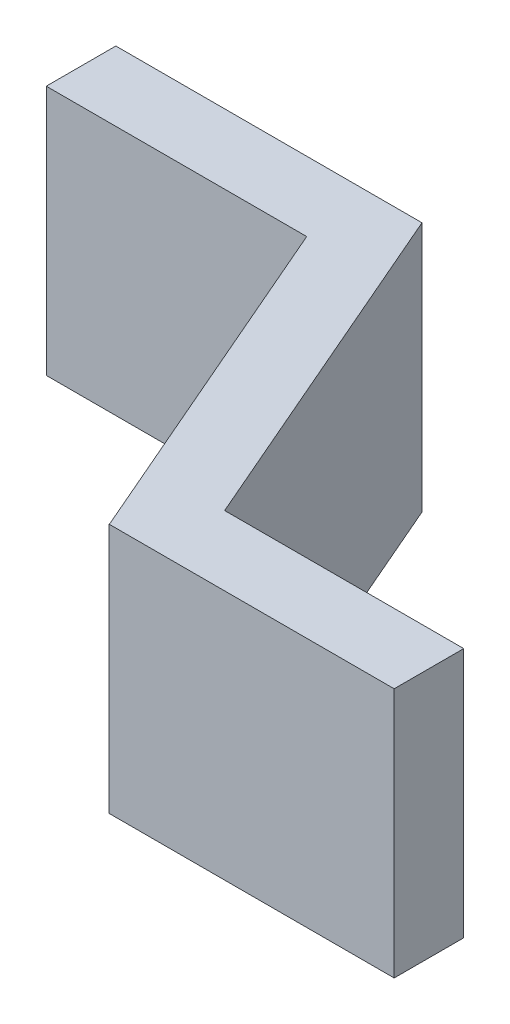
ISO-10303-21;
HEADER;
FILE_DESCRIPTION(('STEP AP214'),'2;1');
FILE_NAME('part.step','',(''),(''),'','','');
FILE_SCHEMA(('AUTOMOTIVE_DESIGN { 1 0 10303 214 1 1 1 1 }'));
ENDSEC;
DATA;
#1=APPLICATION_CONTEXT('core data for automotive mechanical design processes');
#2=APPLICATION_PROTOCOL_DEFINITION('international standard','automotive_design',2000,#1);
#3=PRODUCT_CONTEXT('',#1,'mechanical');
#4=PRODUCT('Part','Part','',(#3));
#5=PRODUCT_RELATED_PRODUCT_CATEGORY('part','',(#4));
#6=PRODUCT_DEFINITION_FORMATION('','',#4);
#7=PRODUCT_DEFINITION_CONTEXT('part definition',#1,'design');
#8=PRODUCT_DEFINITION('design','',#6,#7);
#9=PRODUCT_DEFINITION_SHAPE('','',#8);
#10=(LENGTH_UNIT() NAMED_UNIT(*) SI_UNIT(.MILLI.,.METRE.));
#11=(NAMED_UNIT(*) PLANE_ANGLE_UNIT() SI_UNIT($,.RADIAN.));
#12=(NAMED_UNIT(*) SI_UNIT($,.STERADIAN.) SOLID_ANGLE_UNIT());
#13=UNCERTAINTY_MEASURE_WITH_UNIT(LENGTH_MEASURE(1.E-05),#10,'distance_accuracy_value','');
#14=(GEOMETRIC_REPRESENTATION_CONTEXT(3) GLOBAL_UNCERTAINTY_ASSIGNED_CONTEXT((#13)) GLOBAL_UNIT_ASSIGNED_CONTEXT((#10,
#11,#12)) REPRESENTATION_CONTEXT('',''));
#15=CARTESIAN_POINT('',(0.,0.,0.));
#16=DIRECTION('',(0.,0.,1.));
#17=DIRECTION('',(1.,0.,0.));
#18=AXIS2_PLACEMENT_3D('',#15,#16,#17);
#19=CARTESIAN_POINT('',(0.,3.42,0.));
#20=DIRECTION('',(1.,0.,0.));
#21=DIRECTION('',(0.,0.,-1.));
#22=AXIS2_PLACEMENT_3D('',#19,#20,#21);
#23=PLANE('',#22);
#24=DIRECTION('',(0.,1.,0.));
#25=VECTOR('',#24,1.);
#26=CARTESIAN_POINT('',(0.,3.42,0.));
#27=LINE('',#26,#25);
#28=CARTESIAN_POINT('',(0.,3.780000014305,-1.30339419427667E-10));
#29=VERTEX_POINT('',#28);
#30=CARTESIAN_POINT('',(0.,3.42,-1.556831963824E-10));
#31=VERTEX_POINT('',#30);
#32=EDGE_CURVE('E123',#29,#31,#27,.F.);
#33=ORIENTED_EDGE('',*,*,#32,.T.);
#34=DIRECTION('',(0.,0.,1.));
#35=VECTOR('',#34,1.);
#36=CARTESIAN_POINT('',(0.,3.42,0.));
#37=LINE('',#36,#35);
#38=CARTESIAN_POINT('',(0.,3.42,0.10000000149));
#39=VERTEX_POINT('',#38);
#40=EDGE_CURVE('E115',#31,#39,#37,.T.);
#41=ORIENTED_EDGE('',*,*,#40,.T.);
#42=DIRECTION('',(0.,1.,0.));
#43=VECTOR('',#42,1.);
#44=CARTESIAN_POINT('',(0.,3.42,0.10000000149));
#45=LINE('',#44,#43);
#46=CARTESIAN_POINT('',(0.,3.780000014305,0.10000000149));
#47=VERTEX_POINT('',#46);
#48=EDGE_CURVE('E134',#47,#39,#45,.F.);
#49=ORIENTED_EDGE('',*,*,#48,.F.);
#50=DIRECTION('',(0.,0.,1.));
#51=VECTOR('',#50,1.);
#52=CARTESIAN_POINT('',(0.,3.780000014305,0.));
#53=LINE('',#52,#51);
#54=EDGE_CURVE('E140',#29,#47,#53,.T.);
#55=ORIENTED_EDGE('',*,*,#54,.F.);
#56=EDGE_LOOP('',(#33,#41,#49,#55));
#57=FACE_BOUND('',#56,.T.);
#58=ADVANCED_FACE('F17',(#57),#23,.F.);
#59=CARTESIAN_POINT('',(0.,3.42,0.10000000149));
#60=DIRECTION('',(0.,0.,1.));
#61=DIRECTION('',(1.,0.,0.));
#62=AXIS2_PLACEMENT_3D('',#59,#60,#61);
#63=PLANE('',#62);
#64=DIRECTION('',(0.,1.,0.));
#65=VECTOR('',#64,1.);
#66=CARTESIAN_POINT('',(0.374312226605181,3.42,0.100000001489922));
#67=LINE('',#66,#65);
#68=CARTESIAN_POINT('',(0.37431222660506,3.780000014305,0.100000001489974));
#69=VERTEX_POINT('',#68);
#70=CARTESIAN_POINT('',(0.374312226605091,3.42,0.100000001489974));
#71=VERTEX_POINT('',#70);
#72=EDGE_CURVE('E132',#69,#71,#67,.F.);
#73=ORIENTED_EDGE('',*,*,#72,.F.);
#74=DIRECTION('',(1.,0.,0.));
#75=VECTOR('',#74,1.);
#76=CARTESIAN_POINT('',(0.44,3.780000014305,0.10000000149));
#77=LINE('',#76,#75);
#78=EDGE_CURVE('E137',#47,#69,#77,.T.);
#79=ORIENTED_EDGE('',*,*,#78,.F.);
#80=ORIENTED_EDGE('',*,*,#48,.T.);
#81=DIRECTION('',(1.,0.,0.));
#82=VECTOR('',#81,1.);
#83=CARTESIAN_POINT('',(0.44,3.42,0.10000000149));
#84=LINE('',#83,#82);
#85=EDGE_CURVE('E111',#39,#71,#84,.T.);
#86=ORIENTED_EDGE('',*,*,#85,.T.);
#87=EDGE_LOOP('',(#73,#79,#80,#86));
#88=FACE_BOUND('',#87,.T.);
#89=ADVANCED_FACE('F214',(#88),#63,.T.);
#90=CARTESIAN_POINT('',(0.348224508223,3.42,0.03971472531736));
#91=DIRECTION('',(-0.917754904098641,0.,0.397147247255844));
#92=DIRECTION('',(0.397147247255844,0.,0.917754904098641));
#93=AXIS2_PLACEMENT_3D('',#90,#91,#92);
#94=PLANE('',#93);
#95=DIRECTION('',(0.397147247255413,0.,0.917754904098827));
#96=VECTOR('',#95,1.);
#97=CARTESIAN_POINT('',(0.374312226605,3.42,0.10000000149));
#98=LINE('',#97,#96);
#99=CARTESIAN_POINT('',(0.59,3.42,0.59842599627));
#100=VERTEX_POINT('',#99);
#101=EDGE_CURVE('E110',#71,#100,#98,.T.);
#102=ORIENTED_EDGE('',*,*,#101,.T.);
#103=DIRECTION('',(0.,1.,0.));
#104=VECTOR('',#103,1.);
#105=CARTESIAN_POINT('',(0.59,3.42,0.59842599627));
#106=LINE('',#105,#104);
#107=CARTESIAN_POINT('',(0.59,3.780000014305,0.59842599627));
#108=VERTEX_POINT('',#107);
#109=EDGE_CURVE('E86',#100,#108,#106,.T.);
#110=ORIENTED_EDGE('',*,*,#109,.T.);
#111=DIRECTION('',(0.397147247255413,0.,0.917754904098827));
#112=VECTOR('',#111,1.);
#113=CARTESIAN_POINT('',(0.374312226605,3.780000014305,0.10000000149));
#114=LINE('',#113,#112);
#115=EDGE_CURVE('E139',#69,#108,#114,.T.);
#116=ORIENTED_EDGE('',*,*,#115,.F.);
#117=ORIENTED_EDGE('',*,*,#72,.T.);
#118=EDGE_LOOP('',(#102,#110,#116,#117));
#119=FACE_BOUND('',#118,.T.);
#120=ADVANCED_FACE('F215',(#119),#94,.T.);
#121=CARTESIAN_POINT('',(0.59,3.42,0.5));
#122=DIRECTION('',(1.,0.,0.));
#123=DIRECTION('',(0.,0.,-1.));
#124=AXIS2_PLACEMENT_3D('',#121,#122,#123);
#125=PLANE('',#124);
#126=ORIENTED_EDGE('',*,*,#109,.F.);
#127=DIRECTION('',(0.,0.,-1.));
#128=VECTOR('',#127,1.);
#129=CARTESIAN_POINT('',(0.59,3.42,0.5));
#130=LINE('',#129,#128);
#131=CARTESIAN_POINT('',(0.59,3.42,0.60000000149));
#132=VERTEX_POINT('',#131);
#133=EDGE_CURVE('E20',#100,#132,#130,.F.);
#134=ORIENTED_EDGE('',*,*,#133,.T.);
#135=DIRECTION('',(0.,1.,0.));
#136=VECTOR('',#135,1.);
#137=CARTESIAN_POINT('',(0.59,3.42,0.60000000149));
#138=LINE('',#137,#136);
#139=CARTESIAN_POINT('',(0.59,3.780000014305,0.60000000149));
#140=VERTEX_POINT('',#139);
#141=EDGE_CURVE('E93',#140,#132,#138,.F.);
#142=ORIENTED_EDGE('',*,*,#141,.F.);
#143=DIRECTION('',(0.,0.,1.));
#144=VECTOR('',#143,1.);
#145=CARTESIAN_POINT('',(0.59,3.780000014305,0.));
#146=LINE('',#145,#144);
#147=EDGE_CURVE('E182',#108,#140,#146,.T.);
#148=ORIENTED_EDGE('',*,*,#147,.F.);
#149=EDGE_LOOP('',(#126,#134,#142,#148));
#150=FACE_BOUND('',#149,.T.);
#151=ADVANCED_FACE('F109',(#150),#125,.F.);
#152=CARTESIAN_POINT('',(0.59,3.42,0.60000000149));
#153=DIRECTION('',(0.,0.,1.));
#154=DIRECTION('',(1.,0.,0.));
#155=AXIS2_PLACEMENT_3D('',#152,#153,#154);
#156=PLANE('',#155);
#157=ORIENTED_EDGE('',*,*,#141,.T.);
#158=DIRECTION('',(1.,0.,0.));
#159=VECTOR('',#158,1.);
#160=CARTESIAN_POINT('',(0.44,3.42,0.60000000149));
#161=LINE('',#160,#159);
#162=CARTESIAN_POINT('',(0.999999996424,3.42,0.60000000149));
#163=VERTEX_POINT('',#162);
#164=EDGE_CURVE('E97',#132,#163,#161,.T.);
#165=ORIENTED_EDGE('',*,*,#164,.T.);
#166=DIRECTION('',(0.,1.,0.));
#167=VECTOR('',#166,1.);
#168=CARTESIAN_POINT('',(0.999999996424,3.42,0.60000000149));
#169=LINE('',#168,#167);
#170=CARTESIAN_POINT('',(0.999999996424,3.780000014305,0.60000000149));
#171=VERTEX_POINT('',#170);
#172=EDGE_CURVE('E99',#171,#163,#169,.F.);
#173=ORIENTED_EDGE('',*,*,#172,.F.);
#174=DIRECTION('',(1.,0.,0.));
#175=VECTOR('',#174,1.);
#176=CARTESIAN_POINT('',(0.44,3.780000014305,0.60000000149));
#177=LINE('',#176,#175);
#178=EDGE_CURVE('E98',#140,#171,#177,.T.);
#179=ORIENTED_EDGE('',*,*,#178,.F.);
#180=EDGE_LOOP('',(#157,#165,#173,#179));
#181=FACE_BOUND('',#180,.T.);
#182=ADVANCED_FACE('F95',(#181),#156,.T.);
#183=CARTESIAN_POINT('',(0.999999996424,3.42,0.5));
#184=DIRECTION('',(1.,0.,0.));
#185=DIRECTION('',(0.,0.,-1.));
#186=AXIS2_PLACEMENT_3D('',#183,#184,#185);
#187=PLANE('',#186);
#188=DIRECTION('',(0.,0.,1.));
#189=VECTOR('',#188,1.);
#190=CARTESIAN_POINT('',(0.999999996424,3.42,0.));
#191=LINE('',#190,#189);
#192=CARTESIAN_POINT('',(0.999999996424,3.42,0.5));
#193=VERTEX_POINT('',#192);
#194=EDGE_CURVE('E107',#163,#193,#191,.F.);
#195=ORIENTED_EDGE('',*,*,#194,.T.);
#196=DIRECTION('',(0.,1.,0.));
#197=VECTOR('',#196,1.);
#198=CARTESIAN_POINT('',(0.999999996424,3.42,0.5));
#199=LINE('',#198,#197);
#200=CARTESIAN_POINT('',(0.999999996424,3.780000014305,0.5));
#201=VERTEX_POINT('',#200);
#202=EDGE_CURVE('E192',#193,#201,#199,.T.);
#203=ORIENTED_EDGE('',*,*,#202,.T.);
#204=DIRECTION('',(0.,0.,1.));
#205=VECTOR('',#204,1.);
#206=CARTESIAN_POINT('',(0.999999996424,3.780000014305,0.));
#207=LINE('',#206,#205);
#208=EDGE_CURVE('E126',#171,#201,#207,.F.);
#209=ORIENTED_EDGE('',*,*,#208,.F.);
#210=ORIENTED_EDGE('',*,*,#172,.T.);
#211=EDGE_LOOP('',(#195,#203,#209,#210));
#212=FACE_BOUND('',#211,.T.);
#213=ADVANCED_FACE('F238',(#212),#187,.T.);
#214=CARTESIAN_POINT('',(0.,3.42,0.));
#215=DIRECTION('',(0.,0.,1.));
#216=DIRECTION('',(1.,0.,0.));
#217=AXIS2_PLACEMENT_3D('',#214,#215,#216);
#218=PLANE('',#217);
#219=DIRECTION('',(1.,0.,0.));
#220=VECTOR('',#219,1.);
#221=CARTESIAN_POINT('',(0.44,3.42,-2.335247945736E-10));
#222=LINE('',#221,#220);
#223=CARTESIAN_POINT('',(0.439999999656335,3.42,-3.43069646239979E-10));
#224=VERTEX_POINT('',#223);
#225=EDGE_CURVE('E155',#224,#31,#222,.F.);
#226=ORIENTED_EDGE('',*,*,#225,.T.);
#227=ORIENTED_EDGE('',*,*,#32,.F.);
#228=DIRECTION('',(1.,0.,0.));
#229=VECTOR('',#228,1.);
#230=CARTESIAN_POINT('',(0.44,3.780000014305,-1.955091291415E-10));
#231=LINE('',#230,#229);
#232=CARTESIAN_POINT('',(0.439999999458534,3.780000014305,-1.955091291415E-10));
#233=VERTEX_POINT('',#232);
#234=EDGE_CURVE('E147',#233,#29,#231,.F.);
#235=ORIENTED_EDGE('',*,*,#234,.F.);
#236=DIRECTION('',(0.,1.,0.));
#237=VECTOR('',#236,1.);
#238=CARTESIAN_POINT('',(0.439999999804137,3.42,-4.52614497906357E-10));
#239=LINE('',#238,#237);
#240=EDGE_CURVE('E128',#233,#224,#239,.F.);
#241=ORIENTED_EDGE('',*,*,#240,.T.);
#242=EDGE_LOOP('',(#226,#227,#235,#241));
#243=FACE_BOUND('',#242,.T.);
#244=ADVANCED_FACE('F235',(#243),#218,.F.);
#245=CARTESIAN_POINT('',(0.44,3.42,0.));
#246=DIRECTION('',(0.,1.,0.));
#247=DIRECTION('',(0.,0.,1.));
#248=AXIS2_PLACEMENT_3D('',#245,#246,#247);
#249=PLANE('',#248);
#250=DIRECTION('',(1.,0.,0.));
#251=VECTOR('',#250,1.);
#252=CARTESIAN_POINT('',(0.59,3.42,0.5));
#253=LINE('',#252,#251);
#254=CARTESIAN_POINT('',(0.656368904967001,3.42,0.499999999999999));
#255=VERTEX_POINT('',#254);
#256=EDGE_CURVE('E166',#255,#193,#253,.T.);
#257=ORIENTED_EDGE('',*,*,#256,.T.);
#258=ORIENTED_EDGE('',*,*,#194,.F.);
#259=ORIENTED_EDGE('',*,*,#164,.F.);
#260=ORIENTED_EDGE('',*,*,#133,.F.);
#261=ORIENTED_EDGE('',*,*,#101,.F.);
#262=ORIENTED_EDGE('',*,*,#85,.F.);
#263=ORIENTED_EDGE('',*,*,#40,.F.);
#264=ORIENTED_EDGE('',*,*,#225,.F.);
#265=DIRECTION('',(0.397147247255844,0.,0.917754904098641));
#266=VECTOR('',#265,1.);
#267=CARTESIAN_POINT('',(0.44,3.42,0.));
#268=LINE('',#267,#266);
#269=EDGE_CURVE('E160',#224,#255,#268,.T.);
#270=ORIENTED_EDGE('',*,*,#269,.T.);
#271=EDGE_LOOP('',(#257,#258,#259,#260,#261,#262,#263,#264,#270));
#272=FACE_BOUND('',#271,.T.);
#273=ADVANCED_FACE('F104',(#272),#249,.F.);
#274=CARTESIAN_POINT('',(0.59,3.42,0.5));
#275=DIRECTION('',(0.,0.,1.));
#276=DIRECTION('',(1.,0.,0.));
#277=AXIS2_PLACEMENT_3D('',#274,#275,#276);
#278=PLANE('',#277);
#279=ORIENTED_EDGE('',*,*,#256,.F.);
#280=DIRECTION('',(0.,1.,0.));
#281=VECTOR('',#280,1.);
#282=CARTESIAN_POINT('',(0.656368904967005,3.42,0.499999999999998));
#283=LINE('',#282,#281);
#284=CARTESIAN_POINT('',(0.656368904967001,3.780000014305,0.499999999999999));
#285=VERTEX_POINT('',#284);
#286=EDGE_CURVE('E26',#255,#285,#283,.T.);
#287=ORIENTED_EDGE('',*,*,#286,.T.);
#288=DIRECTION('',(1.,0.,0.));
#289=VECTOR('',#288,1.);
#290=CARTESIAN_POINT('',(0.44,3.780000014305,0.5));
#291=LINE('',#290,#289);
#292=EDGE_CURVE('E34',#201,#285,#291,.F.);
#293=ORIENTED_EDGE('',*,*,#292,.F.);
#294=ORIENTED_EDGE('',*,*,#202,.F.);
#295=EDGE_LOOP('',(#279,#287,#293,#294));
#296=FACE_BOUND('',#295,.T.);
#297=ADVANCED_FACE('F199',(#296),#278,.F.);
#298=CARTESIAN_POINT('',(0.44,3.780000014305,0.));
#299=DIRECTION('',(0.,1.,0.));
#300=DIRECTION('',(0.,0.,1.));
#301=AXIS2_PLACEMENT_3D('',#298,#299,#300);
#302=PLANE('',#301);
#303=ORIENTED_EDGE('',*,*,#178,.T.);
#304=ORIENTED_EDGE('',*,*,#208,.T.);
#305=ORIENTED_EDGE('',*,*,#292,.T.);
#306=DIRECTION('',(0.397147247255844,0.,0.917754904098641));
#307=VECTOR('',#306,1.);
#308=CARTESIAN_POINT('',(0.44,3.780000014305,0.));
#309=LINE('',#308,#307);
#310=EDGE_CURVE('E11',#285,#233,#309,.F.);
#311=ORIENTED_EDGE('',*,*,#310,.T.);
#312=ORIENTED_EDGE('',*,*,#234,.T.);
#313=ORIENTED_EDGE('',*,*,#54,.T.);
#314=ORIENTED_EDGE('',*,*,#78,.T.);
#315=ORIENTED_EDGE('',*,*,#115,.T.);
#316=ORIENTED_EDGE('',*,*,#147,.T.);
#317=EDGE_LOOP('',(#303,#304,#305,#311,#312,#313,#314,#315,#316));
#318=FACE_BOUND('',#317,.T.);
#319=ADVANCED_FACE('F204',(#318),#302,.T.);
#320=CARTESIAN_POINT('',(0.44,3.42,0.));
#321=DIRECTION('',(-0.917754904098641,0.,0.397147247255844));
#322=DIRECTION('',(0.397147247255844,0.,0.917754904098641));
#323=AXIS2_PLACEMENT_3D('',#320,#321,#322);
#324=PLANE('',#323);
#325=ORIENTED_EDGE('',*,*,#286,.F.);
#326=ORIENTED_EDGE('',*,*,#269,.F.);
#327=ORIENTED_EDGE('',*,*,#240,.F.);
#328=ORIENTED_EDGE('',*,*,#310,.F.);
#329=EDGE_LOOP('',(#325,#326,#327,#328));
#330=FACE_BOUND('',#329,.T.);
#331=ADVANCED_FACE('F201',(#330),#324,.F.);
#332=CLOSED_SHELL('',(#58,#89,#120,#151,#182,#213,#244,#273,#297,#319,#331));
#333=MANIFOLD_SOLID_BREP('B1',#332);
#334=ADVANCED_BREP_SHAPE_REPRESENTATION('',(#18,#333),#14);
#335=SHAPE_DEFINITION_REPRESENTATION(#9,#334);
ENDSEC;
END-ISO-10303-21;
